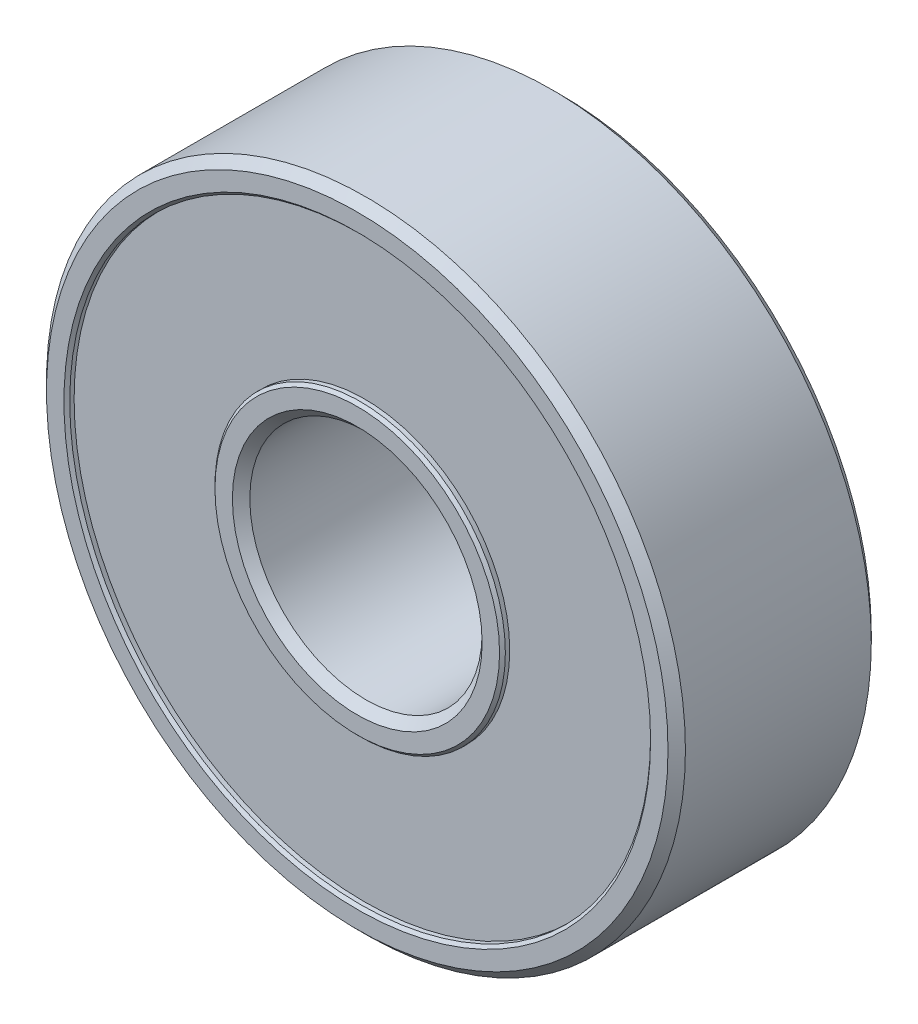
ISO-10303-21;
HEADER;
FILE_DESCRIPTION(('STEP AP214'),'2;1');
FILE_NAME('part.step','',(''),(''),'','','');
FILE_SCHEMA(('AUTOMOTIVE_DESIGN { 1 0 10303 214 1 1 1 1 }'));
ENDSEC;
DATA;
#1=APPLICATION_CONTEXT('core data for automotive mechanical design processes');
#2=APPLICATION_PROTOCOL_DEFINITION('international standard','automotive_design',2000,#1);
#3=PRODUCT_CONTEXT('',#1,'mechanical');
#4=PRODUCT('Part','Part','',(#3));
#5=PRODUCT_RELATED_PRODUCT_CATEGORY('part','',(#4));
#6=PRODUCT_DEFINITION_FORMATION('','',#4);
#7=PRODUCT_DEFINITION_CONTEXT('part definition',#1,'design');
#8=PRODUCT_DEFINITION('design','',#6,#7);
#9=PRODUCT_DEFINITION_SHAPE('','',#8);
#10=(LENGTH_UNIT() NAMED_UNIT(*) SI_UNIT(.MILLI.,.METRE.));
#11=(NAMED_UNIT(*) PLANE_ANGLE_UNIT() SI_UNIT($,.RADIAN.));
#12=(NAMED_UNIT(*) SI_UNIT($,.STERADIAN.) SOLID_ANGLE_UNIT());
#13=UNCERTAINTY_MEASURE_WITH_UNIT(LENGTH_MEASURE(1.E-05),#10,'distance_accuracy_value','');
#14=(GEOMETRIC_REPRESENTATION_CONTEXT(3) GLOBAL_UNCERTAINTY_ASSIGNED_CONTEXT((#13)) GLOBAL_UNIT_ASSIGNED_CONTEXT((#10,
#11,#12)) REPRESENTATION_CONTEXT('',''));
#15=CARTESIAN_POINT('',(0.,0.,0.));
#16=DIRECTION('',(0.,0.,1.));
#17=DIRECTION('',(1.,0.,0.));
#18=AXIS2_PLACEMENT_3D('',#15,#16,#17);
#19=CARTESIAN_POINT('',(0.,0.,3.5));
#20=DIRECTION('',(0.,0.,-1.));
#21=DIRECTION('',(-1.,0.,0.));
#22=AXIS2_PLACEMENT_3D('',#19,#20,#21);
#23=CYLINDRICAL_SURFACE('',#22,10.);
#24=CARTESIAN_POINT('',(0.,0.,-3.35));
#25=DIRECTION('',(0.,0.,1.));
#26=DIRECTION('',(1.,0.,0.));
#27=AXIS2_PLACEMENT_3D('',#24,#25,#26);
#28=CIRCLE('',#27,10.);
#29=CARTESIAN_POINT('',(10.,0.,-3.35));
#30=VERTEX_POINT('',#29);
#31=EDGE_CURVE('E52',#30,#30,#28,.T.);
#32=ORIENTED_EDGE('',*,*,#31,.T.);
#33=EDGE_LOOP('',(#32));
#34=FACE_BOUND('',#33,.T.);
#35=CARTESIAN_POINT('',(0.,0.,-3.5));
#36=DIRECTION('',(0.,0.,1.));
#37=DIRECTION('',(1.,0.,0.));
#38=AXIS2_PLACEMENT_3D('',#35,#36,#37);
#39=CIRCLE('',#38,10.);
#40=CARTESIAN_POINT('',(10.,0.,-3.5));
#41=VERTEX_POINT('',#40);
#42=EDGE_CURVE('E104',#41,#41,#39,.T.);
#43=ORIENTED_EDGE('',*,*,#42,.F.);
#44=EDGE_LOOP('',(#43));
#45=FACE_BOUND('',#44,.T.);
#46=ADVANCED_FACE('F44',(#34,#45),#23,.F.);
#47=CARTESIAN_POINT('',(0.,0.,3.40000000000001));
#48=DIRECTION('',(0.,0.,1.));
#49=DIRECTION('',(1.,0.,0.));
#50=AXIS2_PLACEMENT_3D('',#47,#48,#49);
#51=CIRCLE('',#50,10.);
#52=CARTESIAN_POINT('',(10.,0.,3.40000000000001));
#53=VERTEX_POINT('',#52);
#54=EDGE_CURVE('E74',#53,#53,#51,.T.);
#55=ORIENTED_EDGE('',*,*,#54,.T.);
#56=EDGE_LOOP('',(#55));
#57=FACE_BOUND('',#56,.T.);
#58=CARTESIAN_POINT('',(0.,0.,3.25));
#59=DIRECTION('',(0.,0.,1.));
#60=DIRECTION('',(1.,0.,0.));
#61=AXIS2_PLACEMENT_3D('',#58,#59,#60);
#62=CIRCLE('',#61,10.);
#63=CARTESIAN_POINT('',(10.,0.,3.25));
#64=VERTEX_POINT('',#63);
#65=EDGE_CURVE('E101',#64,#64,#62,.T.);
#66=ORIENTED_EDGE('',*,*,#65,.F.);
#67=EDGE_LOOP('',(#66));
#68=FACE_BOUND('',#67,.T.);
#69=ADVANCED_FACE('F133',(#57,#68),#23,.F.);
#70=CARTESIAN_POINT('',(0.,0.,3.5));
#71=DIRECTION('',(0.,0.,-1.));
#72=DIRECTION('',(-1.,0.,0.));
#73=AXIS2_PLACEMENT_3D('',#70,#71,#72);
#74=CYLINDRICAL_SURFACE('',#73,11.);
#75=CARTESIAN_POINT('',(0.,0.,3.19999999999999));
#76=DIRECTION('',(0.,0.,1.));
#77=DIRECTION('',(1.,0.,0.));
#78=AXIS2_PLACEMENT_3D('',#75,#76,#77);
#79=CIRCLE('',#78,11.);
#80=CARTESIAN_POINT('',(11.,0.,3.19999999999999));
#81=VERTEX_POINT('',#80);
#82=EDGE_CURVE('E80',#81,#81,#79,.F.);
#83=ORIENTED_EDGE('',*,*,#82,.T.);
#84=EDGE_LOOP('',(#83));
#85=FACE_BOUND('',#84,.T.);
#86=CARTESIAN_POINT('',(0.,0.,-3.2));
#87=DIRECTION('',(0.,0.,1.));
#88=DIRECTION('',(1.,0.,0.));
#89=AXIS2_PLACEMENT_3D('',#86,#87,#88);
#90=CIRCLE('',#89,11.);
#91=CARTESIAN_POINT('',(11.,0.,-3.2));
#92=VERTEX_POINT('',#91);
#93=EDGE_CURVE('E83',#92,#92,#90,.T.);
#94=ORIENTED_EDGE('',*,*,#93,.T.);
#95=EDGE_LOOP('',(#94));
#96=FACE_BOUND('',#95,.T.);
#97=ADVANCED_FACE('F138',(#85,#96),#74,.T.);
#98=CARTESIAN_POINT('',(0.,0.,3.5));
#99=DIRECTION('',(0.,0.,1.));
#100=DIRECTION('',(1.,0.,0.));
#101=AXIS2_PLACEMENT_3D('',#98,#99,#100);
#102=PLANE('',#101);
#103=CARTESIAN_POINT('',(0.,0.,3.5));
#104=DIRECTION('',(0.,0.,1.));
#105=DIRECTION('',(1.,0.,0.));
#106=AXIS2_PLACEMENT_3D('',#103,#104,#105);
#107=CIRCLE('',#106,10.1);
#108=CARTESIAN_POINT('',(10.1,0.,3.5));
#109=VERTEX_POINT('',#108);
#110=EDGE_CURVE('E71',#109,#109,#107,.F.);
#111=ORIENTED_EDGE('',*,*,#110,.T.);
#112=EDGE_LOOP('',(#111));
#113=FACE_BOUND('',#112,.T.);
#114=CARTESIAN_POINT('',(0.,0.,3.5));
#115=DIRECTION('',(0.,0.,1.));
#116=DIRECTION('',(1.,0.,0.));
#117=AXIS2_PLACEMENT_3D('',#114,#115,#116);
#118=CIRCLE('',#117,10.7);
#119=CARTESIAN_POINT('',(10.7,0.,3.5));
#120=VERTEX_POINT('',#119);
#121=EDGE_CURVE('E86',#120,#120,#118,.T.);
#122=ORIENTED_EDGE('',*,*,#121,.T.);
#123=EDGE_LOOP('',(#122));
#124=FACE_BOUND('',#123,.T.);
#125=ADVANCED_FACE('F305',(#113,#124),#102,.T.);
#126=CARTESIAN_POINT('',(0.,0.,-3.5));
#127=DIRECTION('',(0.,0.,1.));
#128=DIRECTION('',(1.,0.,0.));
#129=AXIS2_PLACEMENT_3D('',#126,#127,#128);
#130=PLANE('',#129);
#131=CARTESIAN_POINT('',(0.,0.,-3.5));
#132=DIRECTION('',(0.,0.,1.));
#133=DIRECTION('',(1.,0.,0.));
#134=AXIS2_PLACEMENT_3D('',#131,#132,#133);
#135=CIRCLE('',#134,10.7);
#136=CARTESIAN_POINT('',(10.7,0.,-3.5));
#137=VERTEX_POINT('',#136);
#138=EDGE_CURVE('E77',#137,#137,#135,.F.);
#139=ORIENTED_EDGE('',*,*,#138,.T.);
#140=EDGE_LOOP('',(#139));
#141=FACE_BOUND('',#140,.T.);
#142=ORIENTED_EDGE('',*,*,#42,.T.);
#143=EDGE_LOOP('',(#142));
#144=FACE_BOUND('',#143,.T.);
#145=ADVANCED_FACE('F128',(#141,#144),#130,.F.);
#146=CARTESIAN_POINT('',(0.,0.,3.25));
#147=DIRECTION('',(0.,0.,1.));
#148=DIRECTION('',(1.,0.,0.));
#149=AXIS2_PLACEMENT_3D('',#146,#147,#148);
#150=PLANE('',#149);
#151=CARTESIAN_POINT('',(0.,0.,3.25));
#152=DIRECTION('',(0.,0.,1.));
#153=DIRECTION('',(1.,0.,0.));
#154=AXIS2_PLACEMENT_3D('',#151,#152,#153);
#155=CIRCLE('',#154,5.);
#156=CARTESIAN_POINT('',(5.,0.,3.25));
#157=VERTEX_POINT('',#156);
#158=EDGE_CURVE('E107',#157,#157,#155,.T.);
#159=ORIENTED_EDGE('',*,*,#158,.F.);
#160=EDGE_LOOP('',(#159));
#161=FACE_BOUND('',#160,.T.);
#162=ORIENTED_EDGE('',*,*,#65,.T.);
#163=EDGE_LOOP('',(#162));
#164=FACE_BOUND('',#163,.T.);
#165=ADVANCED_FACE('F118',(#161,#164),#150,.T.);
#166=CARTESIAN_POINT('',(0.,0.,-3.25));
#167=DIRECTION('',(0.,0.,1.));
#168=DIRECTION('',(1.,0.,0.));
#169=AXIS2_PLACEMENT_3D('',#166,#167,#168);
#170=PLANE('',#169);
#171=CARTESIAN_POINT('',(0.,0.,-3.25));
#172=DIRECTION('',(0.,0.,1.));
#173=DIRECTION('',(1.,0.,0.));
#174=AXIS2_PLACEMENT_3D('',#171,#172,#173);
#175=CIRCLE('',#174,9.9);
#176=CARTESIAN_POINT('',(9.9,0.,-3.25));
#177=VERTEX_POINT('',#176);
#178=EDGE_CURVE('E11',#177,#177,#175,.F.);
#179=ORIENTED_EDGE('',*,*,#178,.T.);
#180=EDGE_LOOP('',(#179));
#181=FACE_BOUND('',#180,.T.);
#182=CARTESIAN_POINT('',(0.,0.,-3.25));
#183=DIRECTION('',(0.,0.,1.));
#184=DIRECTION('',(1.,0.,0.));
#185=AXIS2_PLACEMENT_3D('',#182,#183,#184);
#186=CIRCLE('',#185,5.);
#187=CARTESIAN_POINT('',(5.,0.,-3.25));
#188=VERTEX_POINT('',#187);
#189=EDGE_CURVE('E110',#188,#188,#186,.F.);
#190=ORIENTED_EDGE('',*,*,#189,.F.);
#191=EDGE_LOOP('',(#190));
#192=FACE_BOUND('',#191,.T.);
#193=ADVANCED_FACE('F116',(#181,#192),#170,.F.);
#194=CARTESIAN_POINT('',(0.,0.,3.5));
#195=DIRECTION('',(0.,0.,-1.));
#196=DIRECTION('',(-1.,0.,0.));
#197=AXIS2_PLACEMENT_3D('',#194,#195,#196);
#198=CYLINDRICAL_SURFACE('',#197,5.);
#199=CARTESIAN_POINT('',(0.,0.,-3.4));
#200=DIRECTION('',(0.,0.,1.));
#201=DIRECTION('',(1.,0.,0.));
#202=AXIS2_PLACEMENT_3D('',#199,#200,#201);
#203=CIRCLE('',#202,5.);
#204=CARTESIAN_POINT('',(5.,0.,-3.4));
#205=VERTEX_POINT('',#204);
#206=EDGE_CURVE('E60',#205,#205,#203,.T.);
#207=ORIENTED_EDGE('',*,*,#206,.T.);
#208=EDGE_LOOP('',(#207));
#209=FACE_BOUND('',#208,.T.);
#210=ORIENTED_EDGE('',*,*,#189,.T.);
#211=EDGE_LOOP('',(#210));
#212=FACE_BOUND('',#211,.T.);
#213=ADVANCED_FACE('F114',(#209,#212),#198,.T.);
#214=CARTESIAN_POINT('',(0.,0.,3.5));
#215=DIRECTION('',(0.,0.,-1.));
#216=DIRECTION('',(-1.,0.,0.));
#217=AXIS2_PLACEMENT_3D('',#214,#215,#216);
#218=CYLINDRICAL_SURFACE('',#217,4.);
#219=CARTESIAN_POINT('',(0.,0.,-3.2));
#220=DIRECTION('',(0.,0.,1.));
#221=DIRECTION('',(1.,0.,0.));
#222=AXIS2_PLACEMENT_3D('',#219,#220,#221);
#223=CIRCLE('',#222,4.);
#224=CARTESIAN_POINT('',(4.,0.,-3.2));
#225=VERTEX_POINT('',#224);
#226=EDGE_CURVE('E92',#225,#225,#223,.F.);
#227=ORIENTED_EDGE('',*,*,#226,.T.);
#228=EDGE_LOOP('',(#227));
#229=FACE_BOUND('',#228,.T.);
#230=CARTESIAN_POINT('',(0.,0.,3.2));
#231=DIRECTION('',(0.,0.,1.));
#232=DIRECTION('',(1.,0.,0.));
#233=AXIS2_PLACEMENT_3D('',#230,#231,#232);
#234=CIRCLE('',#233,4.);
#235=CARTESIAN_POINT('',(4.,0.,3.2));
#236=VERTEX_POINT('',#235);
#237=EDGE_CURVE('E95',#236,#236,#234,.T.);
#238=ORIENTED_EDGE('',*,*,#237,.T.);
#239=EDGE_LOOP('',(#238));
#240=FACE_BOUND('',#239,.T.);
#241=ADVANCED_FACE('F124',(#229,#240),#218,.F.);
#242=CARTESIAN_POINT('',(0.,0.,3.4));
#243=DIRECTION('',(0.,0.,1.));
#244=DIRECTION('',(1.,0.,0.));
#245=AXIS2_PLACEMENT_3D('',#242,#243,#244);
#246=CIRCLE('',#245,5.);
#247=CARTESIAN_POINT('',(5.,0.,3.4));
#248=VERTEX_POINT('',#247);
#249=EDGE_CURVE('E65',#248,#248,#246,.F.);
#250=ORIENTED_EDGE('',*,*,#249,.T.);
#251=EDGE_LOOP('',(#250));
#252=FACE_BOUND('',#251,.T.);
#253=ORIENTED_EDGE('',*,*,#158,.T.);
#254=EDGE_LOOP('',(#253));
#255=FACE_BOUND('',#254,.T.);
#256=ADVANCED_FACE('F127',(#252,#255),#198,.T.);
#257=CARTESIAN_POINT('',(0.,0.,3.5));
#258=DIRECTION('',(0.,0.,1.));
#259=DIRECTION('',(1.,0.,0.));
#260=AXIS2_PLACEMENT_3D('',#257,#258,#259);
#261=PLANE('',#260);
#262=CARTESIAN_POINT('',(0.,0.,3.5));
#263=DIRECTION('',(0.,0.,1.));
#264=DIRECTION('',(1.,0.,0.));
#265=AXIS2_PLACEMENT_3D('',#262,#263,#264);
#266=CIRCLE('',#265,4.9);
#267=CARTESIAN_POINT('',(4.9,0.,3.5));
#268=VERTEX_POINT('',#267);
#269=EDGE_CURVE('E68',#268,#268,#266,.T.);
#270=ORIENTED_EDGE('',*,*,#269,.T.);
#271=EDGE_LOOP('',(#270));
#272=FACE_BOUND('',#271,.T.);
#273=CARTESIAN_POINT('',(0.,0.,3.5));
#274=DIRECTION('',(0.,0.,1.));
#275=DIRECTION('',(1.,0.,0.));
#276=AXIS2_PLACEMENT_3D('',#273,#274,#275);
#277=CIRCLE('',#276,4.3);
#278=CARTESIAN_POINT('',(4.3,0.,3.5));
#279=VERTEX_POINT('',#278);
#280=EDGE_CURVE('E89',#279,#279,#277,.F.);
#281=ORIENTED_EDGE('',*,*,#280,.T.);
#282=EDGE_LOOP('',(#281));
#283=FACE_BOUND('',#282,.T.);
#284=ADVANCED_FACE('F202',(#272,#283),#261,.T.);
#285=CARTESIAN_POINT('',(0.,0.,-3.5));
#286=DIRECTION('',(0.,0.,1.));
#287=DIRECTION('',(1.,0.,0.));
#288=AXIS2_PLACEMENT_3D('',#285,#286,#287);
#289=PLANE('',#288);
#290=CARTESIAN_POINT('',(0.,0.,-3.5));
#291=DIRECTION('',(0.,0.,1.));
#292=DIRECTION('',(1.,0.,0.));
#293=AXIS2_PLACEMENT_3D('',#290,#291,#292);
#294=CIRCLE('',#293,4.9);
#295=CARTESIAN_POINT('',(4.9,0.,-3.5));
#296=VERTEX_POINT('',#295);
#297=EDGE_CURVE('E56',#296,#296,#294,.F.);
#298=ORIENTED_EDGE('',*,*,#297,.T.);
#299=EDGE_LOOP('',(#298));
#300=FACE_BOUND('',#299,.T.);
#301=CARTESIAN_POINT('',(0.,0.,-3.5));
#302=DIRECTION('',(0.,0.,1.));
#303=DIRECTION('',(1.,0.,0.));
#304=AXIS2_PLACEMENT_3D('',#301,#302,#303);
#305=CIRCLE('',#304,4.3);
#306=CARTESIAN_POINT('',(4.3,0.,-3.5));
#307=VERTEX_POINT('',#306);
#308=EDGE_CURVE('E98',#307,#307,#305,.T.);
#309=ORIENTED_EDGE('',*,*,#308,.T.);
#310=EDGE_LOOP('',(#309));
#311=FACE_BOUND('',#310,.T.);
#312=ADVANCED_FACE('F152',(#300,#311),#289,.F.);
#313=CARTESIAN_POINT('',(0.,0.,-3.5));
#314=DIRECTION('',(0.,0.,-1.));
#315=DIRECTION('',(-1.,0.,0.));
#316=AXIS2_PLACEMENT_3D('',#313,#314,#315);
#317=CONICAL_SURFACE('',#316,4.3,0.785398163397451);
#318=ORIENTED_EDGE('',*,*,#226,.F.);
#319=EDGE_LOOP('',(#318));
#320=FACE_BOUND('',#319,.T.);
#321=ORIENTED_EDGE('',*,*,#308,.F.);
#322=EDGE_LOOP('',(#321));
#323=FACE_BOUND('',#322,.T.);
#324=ADVANCED_FACE('F145',(#320,#323),#317,.F.);
#325=CARTESIAN_POINT('',(0.,0.,3.2));
#326=DIRECTION('',(0.,0.,1.));
#327=DIRECTION('',(1.,0.,0.));
#328=AXIS2_PLACEMENT_3D('',#325,#326,#327);
#329=CONICAL_SURFACE('',#328,4.,0.785398163397451);
#330=ORIENTED_EDGE('',*,*,#280,.F.);
#331=EDGE_LOOP('',(#330));
#332=FACE_BOUND('',#331,.T.);
#333=ORIENTED_EDGE('',*,*,#237,.F.);
#334=EDGE_LOOP('',(#333));
#335=FACE_BOUND('',#334,.T.);
#336=ADVANCED_FACE('F151',(#332,#335),#329,.F.);
#337=CARTESIAN_POINT('',(0.,0.,3.5));
#338=DIRECTION('',(0.,0.,-1.));
#339=DIRECTION('',(-1.,0.,0.));
#340=AXIS2_PLACEMENT_3D('',#337,#338,#339);
#341=CONICAL_SURFACE('',#340,10.7,0.785398163397437);
#342=ORIENTED_EDGE('',*,*,#82,.F.);
#343=EDGE_LOOP('',(#342));
#344=FACE_BOUND('',#343,.T.);
#345=ORIENTED_EDGE('',*,*,#121,.F.);
#346=EDGE_LOOP('',(#345));
#347=FACE_BOUND('',#346,.T.);
#348=ADVANCED_FACE('F159',(#344,#347),#341,.T.);
#349=CARTESIAN_POINT('',(0.,0.,-3.2));
#350=DIRECTION('',(0.,0.,1.));
#351=DIRECTION('',(1.,0.,0.));
#352=AXIS2_PLACEMENT_3D('',#349,#350,#351);
#353=CONICAL_SURFACE('',#352,11.,0.785398163397451);
#354=ORIENTED_EDGE('',*,*,#138,.F.);
#355=EDGE_LOOP('',(#354));
#356=FACE_BOUND('',#355,.T.);
#357=ORIENTED_EDGE('',*,*,#93,.F.);
#358=EDGE_LOOP('',(#357));
#359=FACE_BOUND('',#358,.T.);
#360=ADVANCED_FACE('F166',(#356,#359),#353,.T.);
#361=CARTESIAN_POINT('',(0.,0.,3.40000000000001));
#362=DIRECTION('',(0.,0.,1.));
#363=DIRECTION('',(1.,0.,0.));
#364=AXIS2_PLACEMENT_3D('',#361,#362,#363);
#365=CONICAL_SURFACE('',#364,10.,0.78539816339744);
#366=ORIENTED_EDGE('',*,*,#110,.F.);
#367=EDGE_LOOP('',(#366));
#368=FACE_BOUND('',#367,.T.);
#369=ORIENTED_EDGE('',*,*,#54,.F.);
#370=EDGE_LOOP('',(#369));
#371=FACE_BOUND('',#370,.T.);
#372=ADVANCED_FACE('F173',(#368,#371),#365,.F.);
#373=CARTESIAN_POINT('',(0.,0.,3.5));
#374=DIRECTION('',(0.,0.,-1.));
#375=DIRECTION('',(-1.,0.,0.));
#376=AXIS2_PLACEMENT_3D('',#373,#374,#375);
#377=CONICAL_SURFACE('',#376,4.9,0.785398163397448);
#378=ORIENTED_EDGE('',*,*,#249,.F.);
#379=EDGE_LOOP('',(#378));
#380=FACE_BOUND('',#379,.T.);
#381=ORIENTED_EDGE('',*,*,#269,.F.);
#382=EDGE_LOOP('',(#381));
#383=FACE_BOUND('',#382,.T.);
#384=ADVANCED_FACE('F180',(#380,#383),#377,.T.);
#385=CARTESIAN_POINT('',(0.,0.,-3.4));
#386=DIRECTION('',(0.,0.,1.));
#387=DIRECTION('',(1.,0.,0.));
#388=AXIS2_PLACEMENT_3D('',#385,#386,#387);
#389=CONICAL_SURFACE('',#388,5.,0.785398163397444);
#390=ORIENTED_EDGE('',*,*,#297,.F.);
#391=EDGE_LOOP('',(#390));
#392=FACE_BOUND('',#391,.T.);
#393=ORIENTED_EDGE('',*,*,#206,.F.);
#394=EDGE_LOOP('',(#393));
#395=FACE_BOUND('',#394,.T.);
#396=ADVANCED_FACE('F186',(#392,#395),#389,.T.);
#397=CARTESIAN_POINT('',(0.,0.,-3.35));
#398=DIRECTION('',(0.,0.,-1.));
#399=DIRECTION('',(-1.,0.,0.));
#400=AXIS2_PLACEMENT_3D('',#397,#398,#399);
#401=CONICAL_SURFACE('',#400,10.,0.78539816339744);
#402=ORIENTED_EDGE('',*,*,#178,.F.);
#403=EDGE_LOOP('',(#402));
#404=FACE_BOUND('',#403,.T.);
#405=ORIENTED_EDGE('',*,*,#31,.F.);
#406=EDGE_LOOP('',(#405));
#407=FACE_BOUND('',#406,.T.);
#408=ADVANCED_FACE('F47',(#404,#407),#401,.F.);
#409=CLOSED_SHELL('',(#46,#69,#97,#125,#145,#165,#193,#213,#241,#256,#284,#312,#324,#336,#348,
#360,#372,#384,#396,#408));
#410=MANIFOLD_SOLID_BREP('B2',#409);
#411=ADVANCED_BREP_SHAPE_REPRESENTATION('',(#18,#410),#14);
#412=SHAPE_DEFINITION_REPRESENTATION(#9,#411);
ENDSEC;
END-ISO-10303-21;
